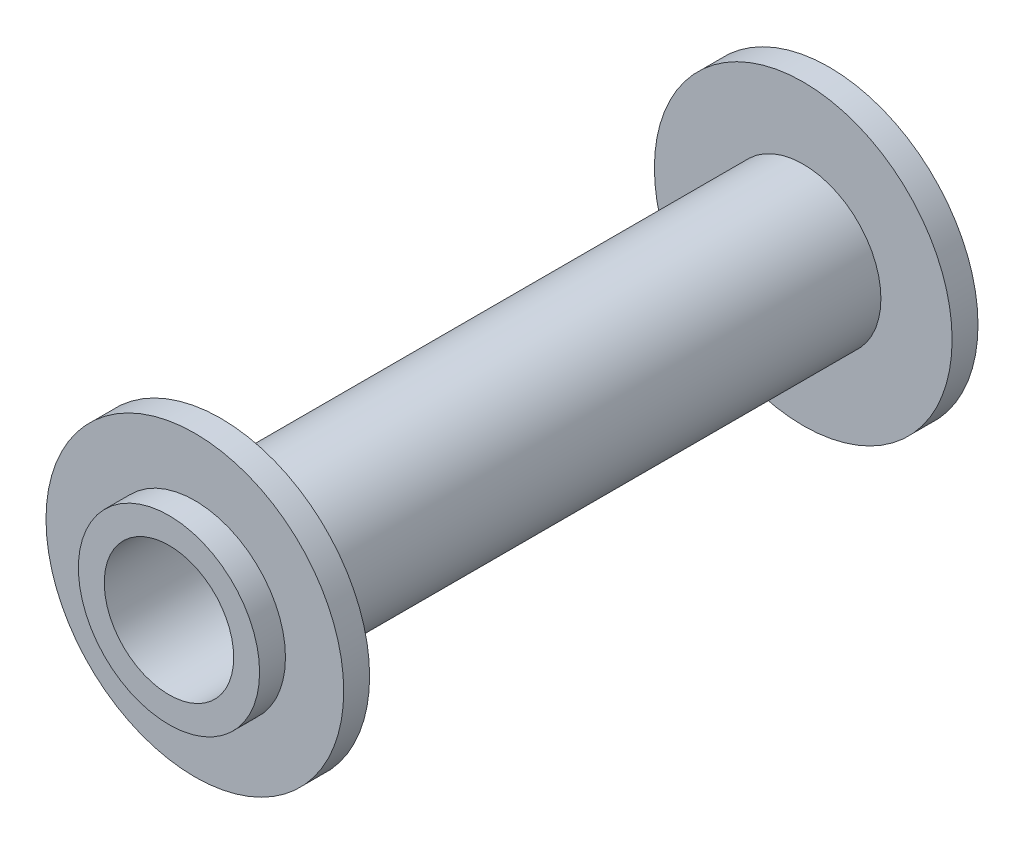
ISO-10303-21;
HEADER;
FILE_DESCRIPTION(('STEP AP214'),'2;1');
FILE_NAME('part.step','',(''),(''),'','','');
FILE_SCHEMA(('AUTOMOTIVE_DESIGN { 1 0 10303 214 1 1 1 1 }'));
ENDSEC;
DATA;
#1=APPLICATION_CONTEXT('core data for automotive mechanical design processes');
#2=APPLICATION_PROTOCOL_DEFINITION('international standard','automotive_design',2000,#1);
#3=PRODUCT_CONTEXT('',#1,'mechanical');
#4=PRODUCT('Part','Part','',(#3));
#5=PRODUCT_RELATED_PRODUCT_CATEGORY('part','',(#4));
#6=PRODUCT_DEFINITION_FORMATION('','',#4);
#7=PRODUCT_DEFINITION_CONTEXT('part definition',#1,'design');
#8=PRODUCT_DEFINITION('design','',#6,#7);
#9=PRODUCT_DEFINITION_SHAPE('','',#8);
#10=(LENGTH_UNIT() NAMED_UNIT(*) SI_UNIT(.MILLI.,.METRE.));
#11=(NAMED_UNIT(*) PLANE_ANGLE_UNIT() SI_UNIT($,.RADIAN.));
#12=(NAMED_UNIT(*) SI_UNIT($,.STERADIAN.) SOLID_ANGLE_UNIT());
#13=UNCERTAINTY_MEASURE_WITH_UNIT(LENGTH_MEASURE(1.E-05),#10,'distance_accuracy_value','');
#14=(GEOMETRIC_REPRESENTATION_CONTEXT(3) GLOBAL_UNCERTAINTY_ASSIGNED_CONTEXT((#13)) GLOBAL_UNIT_ASSIGNED_CONTEXT((#10,
#11,#12)) REPRESENTATION_CONTEXT('',''));
#15=CARTESIAN_POINT('',(0.,0.,0.));
#16=DIRECTION('',(0.,0.,1.));
#17=DIRECTION('',(1.,0.,0.));
#18=AXIS2_PLACEMENT_3D('',#15,#16,#17);
#19=CARTESIAN_POINT('',(0.,0.,0.));
#20=DIRECTION('',(0.,0.,1.));
#21=DIRECTION('',(1.,0.,0.));
#22=AXIS2_PLACEMENT_3D('',#19,#20,#21);
#23=CYLINDRICAL_SURFACE('',#22,5.);
#24=CARTESIAN_POINT('',(0.,0.,-53.));
#25=DIRECTION('',(0.,0.,1.));
#26=DIRECTION('',(1.,0.,0.));
#27=AXIS2_PLACEMENT_3D('',#24,#25,#26);
#28=CIRCLE('',#27,5.);
#29=CARTESIAN_POINT('',(5.,0.,-53.));
#30=VERTEX_POINT('',#29);
#31=EDGE_CURVE('E71',#30,#30,#28,.T.);
#32=ORIENTED_EDGE('',*,*,#31,.F.);
#33=EDGE_LOOP('',(#32));
#34=FACE_BOUND('',#33,.T.);
#35=CARTESIAN_POINT('',(0.,0.,0.));
#36=DIRECTION('',(0.,0.,1.));
#37=DIRECTION('',(1.,0.,0.));
#38=AXIS2_PLACEMENT_3D('',#35,#36,#37);
#39=CIRCLE('',#38,4.99999999999999);
#40=CARTESIAN_POINT('',(4.99999999999999,0.,0.));
#41=VERTEX_POINT('',#40);
#42=EDGE_CURVE('E10',#41,#41,#39,.T.);
#43=ORIENTED_EDGE('',*,*,#42,.T.);
#44=EDGE_LOOP('',(#43));
#45=FACE_BOUND('',#44,.T.);
#46=ADVANCED_FACE('F31',(#34,#45),#23,.F.);
#47=CARTESIAN_POINT('',(0.,4.99999999999999,0.));
#48=DIRECTION('',(0.,0.,-1.));
#49=DIRECTION('',(-1.,0.,0.));
#50=AXIS2_PLACEMENT_3D('',#47,#48,#49);
#51=PLANE('',#50);
#52=ORIENTED_EDGE('',*,*,#42,.F.);
#53=EDGE_LOOP('',(#52));
#54=FACE_BOUND('',#53,.T.);
#55=CARTESIAN_POINT('',(0.,0.,0.));
#56=DIRECTION('',(0.,0.,1.));
#57=DIRECTION('',(1.,0.,0.));
#58=AXIS2_PLACEMENT_3D('',#55,#56,#57);
#59=CIRCLE('',#58,6.99999999999999);
#60=CARTESIAN_POINT('',(6.99999999999999,0.,0.));
#61=VERTEX_POINT('',#60);
#62=EDGE_CURVE('E37',#61,#61,#59,.T.);
#63=ORIENTED_EDGE('',*,*,#62,.T.);
#64=EDGE_LOOP('',(#63));
#65=FACE_BOUND('',#64,.T.);
#66=ADVANCED_FACE('F78',(#54,#65),#51,.F.);
#67=CARTESIAN_POINT('',(0.,0.,0.));
#68=DIRECTION('',(0.,0.,1.));
#69=DIRECTION('',(1.,0.,0.));
#70=AXIS2_PLACEMENT_3D('',#67,#68,#69);
#71=CYLINDRICAL_SURFACE('',#70,6.99999999999999);
#72=ORIENTED_EDGE('',*,*,#62,.F.);
#73=EDGE_LOOP('',(#72));
#74=FACE_BOUND('',#73,.T.);
#75=CARTESIAN_POINT('',(0.,0.,-2.));
#76=DIRECTION('',(0.,0.,1.));
#77=DIRECTION('',(1.,0.,0.));
#78=AXIS2_PLACEMENT_3D('',#75,#76,#77);
#79=CIRCLE('',#78,6.99999999999999);
#80=CARTESIAN_POINT('',(6.99999999999999,0.,-2.));
#81=VERTEX_POINT('',#80);
#82=EDGE_CURVE('E41',#81,#81,#79,.T.);
#83=ORIENTED_EDGE('',*,*,#82,.T.);
#84=EDGE_LOOP('',(#83));
#85=FACE_BOUND('',#84,.T.);
#86=ADVANCED_FACE('F82',(#74,#85),#71,.T.);
#87=CARTESIAN_POINT('',(0.,11.5,-2.));
#88=DIRECTION('',(0.,0.,-1.));
#89=DIRECTION('',(-1.,0.,0.));
#90=AXIS2_PLACEMENT_3D('',#87,#88,#89);
#91=PLANE('',#90);
#92=ORIENTED_EDGE('',*,*,#82,.F.);
#93=EDGE_LOOP('',(#92));
#94=FACE_BOUND('',#93,.T.);
#95=CARTESIAN_POINT('',(0.,0.,-2.));
#96=DIRECTION('',(0.,0.,1.));
#97=DIRECTION('',(1.,0.,0.));
#98=AXIS2_PLACEMENT_3D('',#95,#96,#97);
#99=CIRCLE('',#98,11.5);
#100=CARTESIAN_POINT('',(11.5,0.,-2.));
#101=VERTEX_POINT('',#100);
#102=EDGE_CURVE('E45',#101,#101,#99,.T.);
#103=ORIENTED_EDGE('',*,*,#102,.T.);
#104=EDGE_LOOP('',(#103));
#105=FACE_BOUND('',#104,.T.);
#106=ADVANCED_FACE('F87',(#94,#105),#91,.F.);
#107=CARTESIAN_POINT('',(0.,0.,0.));
#108=DIRECTION('',(0.,0.,1.));
#109=DIRECTION('',(1.,0.,0.));
#110=AXIS2_PLACEMENT_3D('',#107,#108,#109);
#111=CYLINDRICAL_SURFACE('',#110,11.5);
#112=ORIENTED_EDGE('',*,*,#102,.F.);
#113=EDGE_LOOP('',(#112));
#114=FACE_BOUND('',#113,.T.);
#115=CARTESIAN_POINT('',(0.,0.,-4.));
#116=DIRECTION('',(0.,0.,1.));
#117=DIRECTION('',(1.,0.,0.));
#118=AXIS2_PLACEMENT_3D('',#115,#116,#117);
#119=CIRCLE('',#118,11.5);
#120=CARTESIAN_POINT('',(11.5,0.,-4.));
#121=VERTEX_POINT('',#120);
#122=EDGE_CURVE('E50',#121,#121,#119,.T.);
#123=ORIENTED_EDGE('',*,*,#122,.T.);
#124=EDGE_LOOP('',(#123));
#125=FACE_BOUND('',#124,.T.);
#126=ADVANCED_FACE('F93',(#114,#125),#111,.T.);
#127=CARTESIAN_POINT('',(0.,5.99999999999999,-4.));
#128=DIRECTION('',(0.,0.,1.));
#129=DIRECTION('',(1.,0.,0.));
#130=AXIS2_PLACEMENT_3D('',#127,#128,#129);
#131=PLANE('',#130);
#132=ORIENTED_EDGE('',*,*,#122,.F.);
#133=EDGE_LOOP('',(#132));
#134=FACE_BOUND('',#133,.T.);
#135=CARTESIAN_POINT('',(0.,0.,-4.));
#136=DIRECTION('',(0.,0.,1.));
#137=DIRECTION('',(1.,0.,0.));
#138=AXIS2_PLACEMENT_3D('',#135,#136,#137);
#139=CIRCLE('',#138,5.99999999999999);
#140=CARTESIAN_POINT('',(5.99999999999999,0.,-4.));
#141=VERTEX_POINT('',#140);
#142=EDGE_CURVE('E53',#141,#141,#139,.T.);
#143=ORIENTED_EDGE('',*,*,#142,.T.);
#144=EDGE_LOOP('',(#143));
#145=FACE_BOUND('',#144,.T.);
#146=ADVANCED_FACE('F97',(#134,#145),#131,.F.);
#147=CARTESIAN_POINT('',(0.,0.,0.));
#148=DIRECTION('',(0.,0.,1.));
#149=DIRECTION('',(1.,0.,0.));
#150=AXIS2_PLACEMENT_3D('',#147,#148,#149);
#151=CYLINDRICAL_SURFACE('',#150,5.99999999999999);
#152=ORIENTED_EDGE('',*,*,#142,.F.);
#153=EDGE_LOOP('',(#152));
#154=FACE_BOUND('',#153,.T.);
#155=CARTESIAN_POINT('',(0.,0.,-49.));
#156=DIRECTION('',(0.,0.,1.));
#157=DIRECTION('',(1.,0.,0.));
#158=AXIS2_PLACEMENT_3D('',#155,#156,#157);
#159=CIRCLE('',#158,5.99999999999999);
#160=CARTESIAN_POINT('',(5.99999999999999,0.,-49.));
#161=VERTEX_POINT('',#160);
#162=EDGE_CURVE('E56',#161,#161,#159,.T.);
#163=ORIENTED_EDGE('',*,*,#162,.T.);
#164=EDGE_LOOP('',(#163));
#165=FACE_BOUND('',#164,.T.);
#166=ADVANCED_FACE('F101',(#154,#165),#151,.T.);
#167=CARTESIAN_POINT('',(0.,5.99999999999999,-49.));
#168=DIRECTION('',(0.,0.,-1.));
#169=DIRECTION('',(-1.,0.,0.));
#170=AXIS2_PLACEMENT_3D('',#167,#168,#169);
#171=PLANE('',#170);
#172=ORIENTED_EDGE('',*,*,#162,.F.);
#173=EDGE_LOOP('',(#172));
#174=FACE_BOUND('',#173,.T.);
#175=CARTESIAN_POINT('',(0.,0.,-49.));
#176=DIRECTION('',(0.,0.,1.));
#177=DIRECTION('',(1.,0.,0.));
#178=AXIS2_PLACEMENT_3D('',#175,#176,#177);
#179=CIRCLE('',#178,11.5);
#180=CARTESIAN_POINT('',(11.5,0.,-49.));
#181=VERTEX_POINT('',#180);
#182=EDGE_CURVE('E59',#181,#181,#179,.T.);
#183=ORIENTED_EDGE('',*,*,#182,.T.);
#184=EDGE_LOOP('',(#183));
#185=FACE_BOUND('',#184,.T.);
#186=ADVANCED_FACE('F105',(#174,#185),#171,.F.);
#187=CARTESIAN_POINT('',(0.,0.,0.));
#188=DIRECTION('',(0.,0.,1.));
#189=DIRECTION('',(1.,0.,0.));
#190=AXIS2_PLACEMENT_3D('',#187,#188,#189);
#191=CYLINDRICAL_SURFACE('',#190,11.5);
#192=ORIENTED_EDGE('',*,*,#182,.F.);
#193=EDGE_LOOP('',(#192));
#194=FACE_BOUND('',#193,.T.);
#195=CARTESIAN_POINT('',(0.,0.,-51.));
#196=DIRECTION('',(0.,0.,1.));
#197=DIRECTION('',(1.,0.,0.));
#198=AXIS2_PLACEMENT_3D('',#195,#196,#197);
#199=CIRCLE('',#198,11.5);
#200=CARTESIAN_POINT('',(11.5,0.,-51.));
#201=VERTEX_POINT('',#200);
#202=EDGE_CURVE('E62',#201,#201,#199,.T.);
#203=ORIENTED_EDGE('',*,*,#202,.T.);
#204=EDGE_LOOP('',(#203));
#205=FACE_BOUND('',#204,.T.);
#206=ADVANCED_FACE('F109',(#194,#205),#191,.T.);
#207=CARTESIAN_POINT('',(0.,11.5,-51.));
#208=DIRECTION('',(0.,0.,1.));
#209=DIRECTION('',(1.,0.,0.));
#210=AXIS2_PLACEMENT_3D('',#207,#208,#209);
#211=PLANE('',#210);
#212=ORIENTED_EDGE('',*,*,#202,.F.);
#213=EDGE_LOOP('',(#212));
#214=FACE_BOUND('',#213,.T.);
#215=CARTESIAN_POINT('',(0.,0.,-51.));
#216=DIRECTION('',(0.,0.,1.));
#217=DIRECTION('',(1.,0.,0.));
#218=AXIS2_PLACEMENT_3D('',#215,#216,#217);
#219=CIRCLE('',#218,7.);
#220=CARTESIAN_POINT('',(7.,0.,-51.));
#221=VERTEX_POINT('',#220);
#222=EDGE_CURVE('E65',#221,#221,#219,.T.);
#223=ORIENTED_EDGE('',*,*,#222,.T.);
#224=EDGE_LOOP('',(#223));
#225=FACE_BOUND('',#224,.T.);
#226=ADVANCED_FACE('F113',(#214,#225),#211,.F.);
#227=CARTESIAN_POINT('',(0.,0.,0.));
#228=DIRECTION('',(0.,0.,1.));
#229=DIRECTION('',(1.,0.,0.));
#230=AXIS2_PLACEMENT_3D('',#227,#228,#229);
#231=CYLINDRICAL_SURFACE('',#230,7.);
#232=ORIENTED_EDGE('',*,*,#222,.F.);
#233=EDGE_LOOP('',(#232));
#234=FACE_BOUND('',#233,.T.);
#235=CARTESIAN_POINT('',(0.,0.,-53.));
#236=DIRECTION('',(0.,0.,1.));
#237=DIRECTION('',(1.,0.,0.));
#238=AXIS2_PLACEMENT_3D('',#235,#236,#237);
#239=CIRCLE('',#238,7.);
#240=CARTESIAN_POINT('',(7.,0.,-53.));
#241=VERTEX_POINT('',#240);
#242=EDGE_CURVE('E68',#241,#241,#239,.T.);
#243=ORIENTED_EDGE('',*,*,#242,.T.);
#244=EDGE_LOOP('',(#243));
#245=FACE_BOUND('',#244,.T.);
#246=ADVANCED_FACE('F117',(#234,#245),#231,.T.);
#247=CARTESIAN_POINT('',(0.,7.,-53.));
#248=DIRECTION('',(0.,0.,1.));
#249=DIRECTION('',(1.,0.,0.));
#250=AXIS2_PLACEMENT_3D('',#247,#248,#249);
#251=PLANE('',#250);
#252=ORIENTED_EDGE('',*,*,#242,.F.);
#253=EDGE_LOOP('',(#252));
#254=FACE_BOUND('',#253,.T.);
#255=ORIENTED_EDGE('',*,*,#31,.T.);
#256=EDGE_LOOP('',(#255));
#257=FACE_BOUND('',#256,.T.);
#258=ADVANCED_FACE('F75',(#254,#257),#251,.F.);
#259=CLOSED_SHELL('',(#46,#66,#86,#106,#126,#146,#166,#186,#206,#226,#246,#258));
#260=MANIFOLD_SOLID_BREP('B2',#259);
#261=ADVANCED_BREP_SHAPE_REPRESENTATION('',(#18,#260),#14);
#262=SHAPE_DEFINITION_REPRESENTATION(#9,#261);
ENDSEC;
END-ISO-10303-21;
